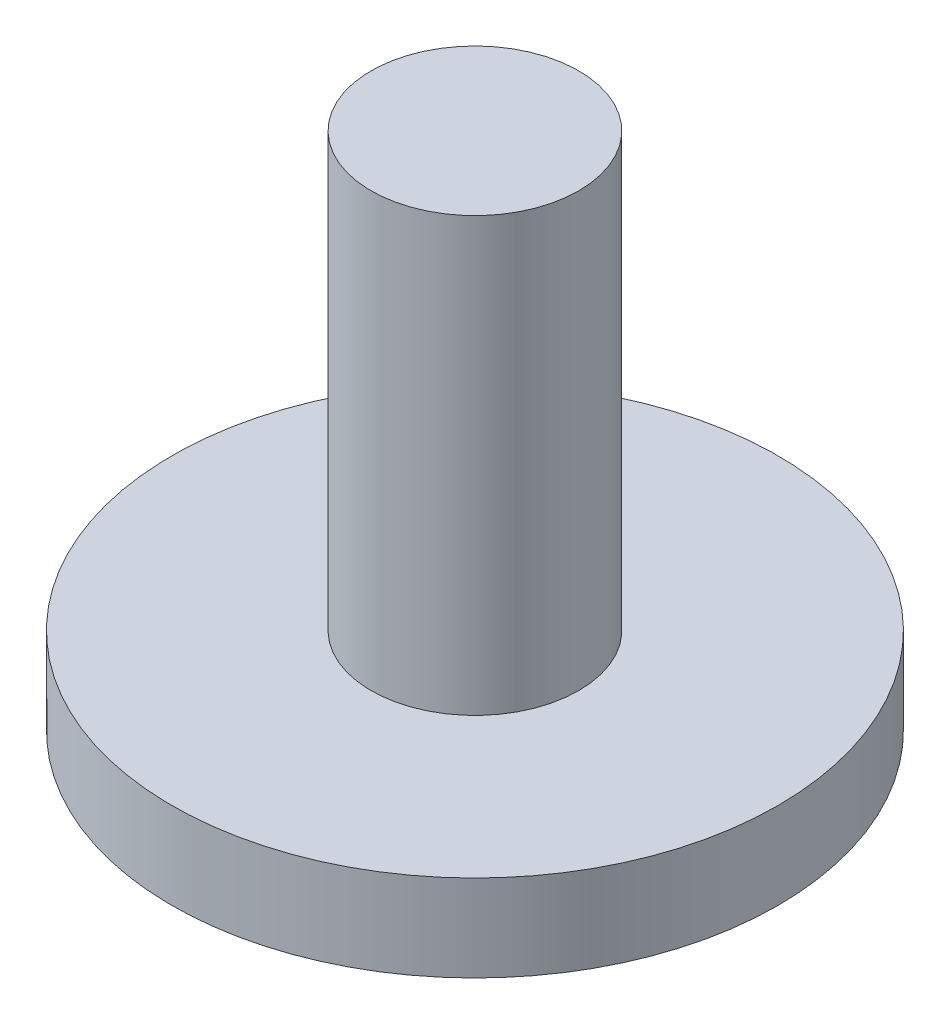
ISO-10303-21;
HEADER;
FILE_DESCRIPTION(('STEP AP214'),'2;1');
FILE_NAME('part.step','',(''),(''),'','','');
FILE_SCHEMA(('AUTOMOTIVE_DESIGN { 1 0 10303 214 1 1 1 1 }'));
ENDSEC;
DATA;
#1=APPLICATION_CONTEXT('core data for automotive mechanical design processes');
#2=APPLICATION_PROTOCOL_DEFINITION('international standard','automotive_design',2000,#1);
#3=PRODUCT_CONTEXT('',#1,'mechanical');
#4=PRODUCT('Part','Part','',(#3));
#5=PRODUCT_RELATED_PRODUCT_CATEGORY('part','',(#4));
#6=PRODUCT_DEFINITION_FORMATION('','',#4);
#7=PRODUCT_DEFINITION_CONTEXT('part definition',#1,'design');
#8=PRODUCT_DEFINITION('design','',#6,#7);
#9=PRODUCT_DEFINITION_SHAPE('','',#8);
#10=(LENGTH_UNIT() NAMED_UNIT(*) SI_UNIT(.MILLI.,.METRE.));
#11=(NAMED_UNIT(*) PLANE_ANGLE_UNIT() SI_UNIT($,.RADIAN.));
#12=(NAMED_UNIT(*) SI_UNIT($,.STERADIAN.) SOLID_ANGLE_UNIT());
#13=UNCERTAINTY_MEASURE_WITH_UNIT(LENGTH_MEASURE(1.E-05),#10,'distance_accuracy_value','');
#14=(GEOMETRIC_REPRESENTATION_CONTEXT(3) GLOBAL_UNCERTAINTY_ASSIGNED_CONTEXT((#13)) GLOBAL_UNIT_ASSIGNED_CONTEXT((#10,
#11,#12)) REPRESENTATION_CONTEXT('',''));
#15=CARTESIAN_POINT('',(0.,0.,0.));
#16=DIRECTION('',(0.,0.,1.));
#17=DIRECTION('',(1.,0.,0.));
#18=AXIS2_PLACEMENT_3D('',#15,#16,#17);
#19=CARTESIAN_POINT('',(-1.31155863915721E-12,5.99999999999999,0.));
#20=DIRECTION('',(0.,1.,0.));
#21=DIRECTION('',(-1.,0.,0.));
#22=AXIS2_PLACEMENT_3D('',#19,#20,#21);
#23=PLANE('',#22);
#24=CARTESIAN_POINT('',(0.,6.00000000000001,0.));
#25=DIRECTION('',(0.,-1.,0.));
#26=DIRECTION('',(1.,0.,0.));
#27=AXIS2_PLACEMENT_3D('',#24,#25,#26);
#28=CIRCLE('',#27,2.39999999999871);
#29=CARTESIAN_POINT('',(2.39999999999869,6.00000000000001,0.));
#30=VERTEX_POINT('',#29);
#31=EDGE_CURVE('E10',#30,#30,#28,.T.);
#32=ORIENTED_EDGE('',*,*,#31,.F.);
#33=EDGE_LOOP('',(#32));
#34=FACE_BOUND('',#33,.T.);
#35=ADVANCED_FACE('F32',(#34),#23,.T.);
#36=CARTESIAN_POINT('',(1.38714461993588E-12,-404.385984920179,0.));
#37=DIRECTION('',(0.,-1.,0.));
#38=DIRECTION('',(1.,0.,0.));
#39=AXIS2_PLACEMENT_3D('',#36,#37,#38);
#40=CYLINDRICAL_SURFACE('',#39,2.39999999999869);
#41=ORIENTED_EDGE('',*,*,#31,.T.);
#42=EDGE_LOOP('',(#41));
#43=FACE_BOUND('',#42,.T.);
#44=CARTESIAN_POINT('',(0.,-4.,0.));
#45=DIRECTION('',(0.,-1.,0.));
#46=DIRECTION('',(1.,0.,0.));
#47=AXIS2_PLACEMENT_3D('',#44,#45,#46);
#48=CIRCLE('',#47,2.39999999999868);
#49=CARTESIAN_POINT('',(2.39999999999869,-4.,0.));
#50=VERTEX_POINT('',#49);
#51=EDGE_CURVE('E38',#50,#50,#48,.T.);
#52=ORIENTED_EDGE('',*,*,#51,.F.);
#53=EDGE_LOOP('',(#52));
#54=FACE_BOUND('',#53,.T.);
#55=ADVANCED_FACE('F64',(#43,#54),#40,.T.);
#56=CARTESIAN_POINT('',(2.39999999999869,-4.00000000000001,0.));
#57=DIRECTION('',(0.,1.,0.));
#58=DIRECTION('',(-1.,0.,0.));
#59=AXIS2_PLACEMENT_3D('',#56,#57,#58);
#60=PLANE('',#59);
#61=ORIENTED_EDGE('',*,*,#51,.T.);
#62=EDGE_LOOP('',(#61));
#63=FACE_BOUND('',#62,.T.);
#64=CARTESIAN_POINT('',(0.,-4.,0.));
#65=DIRECTION('',(0.,-1.,0.));
#66=DIRECTION('',(1.,0.,0.));
#67=AXIS2_PLACEMENT_3D('',#64,#65,#66);
#68=CIRCLE('',#67,6.99999999999867);
#69=CARTESIAN_POINT('',(6.99999999999869,-3.99999999999998,0.));
#70=VERTEX_POINT('',#69);
#71=EDGE_CURVE('E42',#70,#70,#68,.T.);
#72=ORIENTED_EDGE('',*,*,#71,.F.);
#73=EDGE_LOOP('',(#72));
#74=FACE_BOUND('',#73,.T.);
#75=ADVANCED_FACE('F56',(#63,#74),#60,.T.);
#76=CARTESIAN_POINT('',(1.38714461993588E-12,-404.385984920179,0.));
#77=DIRECTION('',(0.,-1.,0.));
#78=DIRECTION('',(1.,0.,0.));
#79=AXIS2_PLACEMENT_3D('',#76,#77,#78);
#80=CYLINDRICAL_SURFACE('',#79,6.99999999999867);
#81=ORIENTED_EDGE('',*,*,#71,.T.);
#82=EDGE_LOOP('',(#81));
#83=FACE_BOUND('',#82,.T.);
#84=CARTESIAN_POINT('',(0.,-6.00000000000001,0.));
#85=DIRECTION('',(0.,-1.,0.));
#86=DIRECTION('',(1.,0.,0.));
#87=AXIS2_PLACEMENT_3D('',#84,#85,#86);
#88=CIRCLE('',#87,6.99999999999867);
#89=CARTESIAN_POINT('',(6.99999999999869,-5.99999999999998,0.));
#90=VERTEX_POINT('',#89);
#91=EDGE_CURVE('E46',#90,#90,#88,.T.);
#92=ORIENTED_EDGE('',*,*,#91,.F.);
#93=EDGE_LOOP('',(#92));
#94=FACE_BOUND('',#93,.T.);
#95=ADVANCED_FACE('F54',(#83,#94),#80,.T.);
#96=CARTESIAN_POINT('',(6.99999999999869,-5.99999999999999,0.));
#97=DIRECTION('',(0.,-1.,0.));
#98=DIRECTION('',(1.,0.,0.));
#99=AXIS2_PLACEMENT_3D('',#96,#97,#98);
#100=PLANE('',#99);
#101=ORIENTED_EDGE('',*,*,#91,.T.);
#102=EDGE_LOOP('',(#101));
#103=FACE_BOUND('',#102,.T.);
#104=ADVANCED_FACE('F52',(#103),#100,.T.);
#105=CLOSED_SHELL('',(#35,#55,#75,#95,#104));
#106=MANIFOLD_SOLID_BREP('B2',#105);
#107=ADVANCED_BREP_SHAPE_REPRESENTATION('',(#18,#106),#14);
#108=SHAPE_DEFINITION_REPRESENTATION(#9,#107);
ENDSEC;
END-ISO-10303-21;
